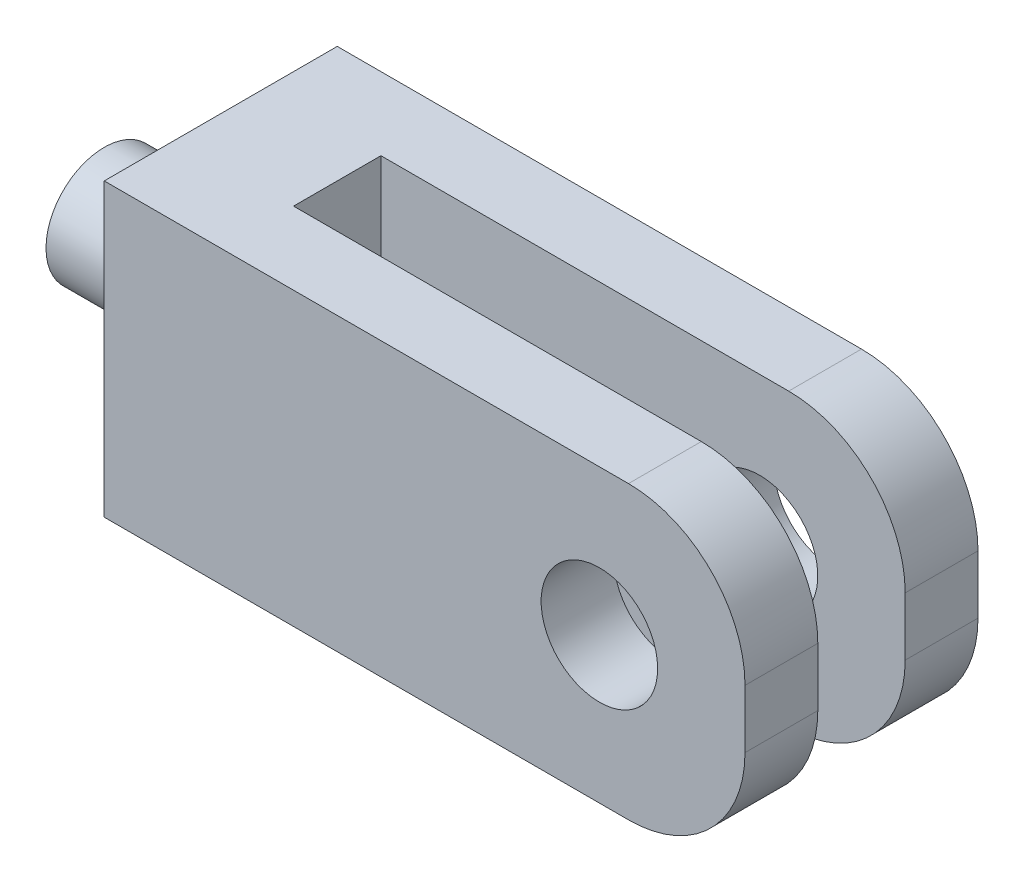
ISO-10303-21;
HEADER;
FILE_DESCRIPTION(('STEP AP214'),'2;1');
FILE_NAME('part.step','',(''),(''),'','','');
FILE_SCHEMA(('AUTOMOTIVE_DESIGN { 1 0 10303 214 1 1 1 1 }'));
ENDSEC;
DATA;
#1=APPLICATION_CONTEXT('core data for automotive mechanical design processes');
#2=APPLICATION_PROTOCOL_DEFINITION('international standard','automotive_design',2000,#1);
#3=PRODUCT_CONTEXT('',#1,'mechanical');
#4=PRODUCT('Part','Part','',(#3));
#5=PRODUCT_RELATED_PRODUCT_CATEGORY('part','',(#4));
#6=PRODUCT_DEFINITION_FORMATION('','',#4);
#7=PRODUCT_DEFINITION_CONTEXT('part definition',#1,'design');
#8=PRODUCT_DEFINITION('design','',#6,#7);
#9=PRODUCT_DEFINITION_SHAPE('','',#8);
#10=(LENGTH_UNIT() NAMED_UNIT(*) SI_UNIT(.MILLI.,.METRE.));
#11=(NAMED_UNIT(*) PLANE_ANGLE_UNIT() SI_UNIT($,.RADIAN.));
#12=(NAMED_UNIT(*) SI_UNIT($,.STERADIAN.) SOLID_ANGLE_UNIT());
#13=UNCERTAINTY_MEASURE_WITH_UNIT(LENGTH_MEASURE(1.E-05),#10,'distance_accuracy_value','');
#14=(GEOMETRIC_REPRESENTATION_CONTEXT(3) GLOBAL_UNCERTAINTY_ASSIGNED_CONTEXT((#13)) GLOBAL_UNIT_ASSIGNED_CONTEXT((#10,
#11,#12)) REPRESENTATION_CONTEXT('',''));
#15=CARTESIAN_POINT('',(0.,0.,0.));
#16=DIRECTION('',(0.,0.,1.));
#17=DIRECTION('',(1.,0.,0.));
#18=AXIS2_PLACEMENT_3D('',#15,#16,#17);
#19=CARTESIAN_POINT('',(55.,-25.,40.));
#20=DIRECTION('',(-1.,0.,0.));
#21=DIRECTION('',(0.,0.,1.));
#22=AXIS2_PLACEMENT_3D('',#19,#20,#21);
#23=PLANE('',#22);
#24=DIRECTION('',(0.,1.,0.));
#25=VECTOR('',#24,1.);
#26=CARTESIAN_POINT('',(55.,-25.,40.));
#27=LINE('',#26,#25);
#28=CARTESIAN_POINT('',(55.,-5.,40.));
#29=VERTEX_POINT('',#28);
#30=CARTESIAN_POINT('',(55.,5.,40.));
#31=VERTEX_POINT('',#30);
#32=EDGE_CURVE('E162',#29,#31,#27,.T.);
#33=ORIENTED_EDGE('',*,*,#32,.F.);
#34=DIRECTION('',(0.,0.,-1.));
#35=VECTOR('',#34,1.);
#36=CARTESIAN_POINT('',(55.,-5.,40.));
#37=LINE('',#36,#35);
#38=CARTESIAN_POINT('',(55.,-5.,27.5));
#39=VERTEX_POINT('',#38);
#40=EDGE_CURVE('E204',#29,#39,#37,.T.);
#41=ORIENTED_EDGE('',*,*,#40,.T.);
#42=DIRECTION('',(0.,-1.,0.));
#43=VECTOR('',#42,1.);
#44=CARTESIAN_POINT('',(55.,-25.,27.5));
#45=LINE('',#44,#43);
#46=CARTESIAN_POINT('',(55.,5.,27.5));
#47=VERTEX_POINT('',#46);
#48=EDGE_CURVE('E242',#47,#39,#45,.T.);
#49=ORIENTED_EDGE('',*,*,#48,.F.);
#50=DIRECTION('',(0.,0.,-1.));
#51=VECTOR('',#50,1.);
#52=CARTESIAN_POINT('',(55.,5.,40.));
#53=LINE('',#52,#51);
#54=EDGE_CURVE('E202',#47,#31,#53,.F.);
#55=ORIENTED_EDGE('',*,*,#54,.T.);
#56=EDGE_LOOP('',(#33,#41,#49,#55));
#57=FACE_BOUND('',#56,.T.);
#58=ADVANCED_FACE('F37',(#57),#23,.F.);
#59=DIRECTION('',(0.,1.,0.));
#60=VECTOR('',#59,1.);
#61=CARTESIAN_POINT('',(55.,-25.,12.5));
#62=LINE('',#61,#60);
#63=CARTESIAN_POINT('',(55.,-5.,12.5));
#64=VERTEX_POINT('',#63);
#65=CARTESIAN_POINT('',(55.,5.,12.5));
#66=VERTEX_POINT('',#65);
#67=EDGE_CURVE('E246',#64,#66,#62,.T.);
#68=ORIENTED_EDGE('',*,*,#67,.F.);
#69=DIRECTION('',(0.,0.,-1.));
#70=VECTOR('',#69,1.);
#71=CARTESIAN_POINT('',(55.,-5.,40.));
#72=LINE('',#71,#70);
#73=CARTESIAN_POINT('',(55.,-5.,0.));
#74=VERTEX_POINT('',#73);
#75=EDGE_CURVE('E188',#64,#74,#72,.T.);
#76=ORIENTED_EDGE('',*,*,#75,.T.);
#77=DIRECTION('',(0.,1.,0.));
#78=VECTOR('',#77,1.);
#79=CARTESIAN_POINT('',(55.,-25.,0.));
#80=LINE('',#79,#78);
#81=CARTESIAN_POINT('',(55.,5.,0.));
#82=VERTEX_POINT('',#81);
#83=EDGE_CURVE('E173',#74,#82,#80,.T.);
#84=ORIENTED_EDGE('',*,*,#83,.T.);
#85=DIRECTION('',(0.,0.,-1.));
#86=VECTOR('',#85,1.);
#87=CARTESIAN_POINT('',(55.,5.,40.));
#88=LINE('',#87,#86);
#89=EDGE_CURVE('E186',#82,#66,#88,.F.);
#90=ORIENTED_EDGE('',*,*,#89,.T.);
#91=EDGE_LOOP('',(#68,#76,#84,#90));
#92=FACE_BOUND('',#91,.T.);
#93=ADVANCED_FACE('F267',(#92),#23,.F.);
#94=CARTESIAN_POINT('',(-55.,25.,40.));
#95=DIRECTION('',(0.,-1.,0.));
#96=DIRECTION('',(0.,0.,-1.));
#97=AXIS2_PLACEMENT_3D('',#94,#95,#96);
#98=PLANE('',#97);
#99=DIRECTION('',(1.,0.,0.));
#100=VECTOR('',#99,1.);
#101=CARTESIAN_POINT('',(-35.,25.,12.5));
#102=LINE('',#101,#100);
#103=CARTESIAN_POINT('',(-35.,25.,12.5));
#104=VERTEX_POINT('',#103);
#105=CARTESIAN_POINT('',(35.,25.,12.5));
#106=VERTEX_POINT('',#105);
#107=EDGE_CURVE('E137',#104,#106,#102,.T.);
#108=ORIENTED_EDGE('',*,*,#107,.T.);
#109=DIRECTION('',(0.,0.,-1.));
#110=VECTOR('',#109,1.);
#111=CARTESIAN_POINT('',(35.,25.,40.));
#112=LINE('',#111,#110);
#113=CARTESIAN_POINT('',(35.,25.,0.));
#114=VERTEX_POINT('',#113);
#115=EDGE_CURVE('E46',#106,#114,#112,.T.);
#116=ORIENTED_EDGE('',*,*,#115,.T.);
#117=DIRECTION('',(-1.,0.,0.));
#118=VECTOR('',#117,1.);
#119=CARTESIAN_POINT('',(-55.,25.,0.));
#120=LINE('',#119,#118);
#121=CARTESIAN_POINT('',(-55.,25.,0.));
#122=VERTEX_POINT('',#121);
#123=EDGE_CURVE('E176',#114,#122,#120,.T.);
#124=ORIENTED_EDGE('',*,*,#123,.T.);
#125=DIRECTION('',(0.,0.,-1.));
#126=VECTOR('',#125,1.);
#127=CARTESIAN_POINT('',(-55.,25.,40.));
#128=LINE('',#127,#126);
#129=CARTESIAN_POINT('',(-55.,25.,40.));
#130=VERTEX_POINT('',#129);
#131=EDGE_CURVE('E183',#130,#122,#128,.T.);
#132=ORIENTED_EDGE('',*,*,#131,.F.);
#133=DIRECTION('',(-1.,0.,0.));
#134=VECTOR('',#133,1.);
#135=CARTESIAN_POINT('',(-55.,25.,40.));
#136=LINE('',#135,#134);
#137=CARTESIAN_POINT('',(35.,25.,40.));
#138=VERTEX_POINT('',#137);
#139=EDGE_CURVE('E164',#138,#130,#136,.T.);
#140=ORIENTED_EDGE('',*,*,#139,.F.);
#141=DIRECTION('',(0.,0.,-1.));
#142=VECTOR('',#141,1.);
#143=CARTESIAN_POINT('',(35.,25.,40.));
#144=LINE('',#143,#142);
#145=CARTESIAN_POINT('',(35.,25.,27.5));
#146=VERTEX_POINT('',#145);
#147=EDGE_CURVE('E213',#138,#146,#144,.T.);
#148=ORIENTED_EDGE('',*,*,#147,.T.);
#149=DIRECTION('',(1.,0.,0.));
#150=VECTOR('',#149,1.);
#151=CARTESIAN_POINT('',(-35.,25.,27.5));
#152=LINE('',#151,#150);
#153=CARTESIAN_POINT('',(-35.,25.,27.5));
#154=VERTEX_POINT('',#153);
#155=EDGE_CURVE('E157',#154,#146,#152,.T.);
#156=ORIENTED_EDGE('',*,*,#155,.F.);
#157=DIRECTION('',(0.,0.,1.));
#158=VECTOR('',#157,1.);
#159=CARTESIAN_POINT('',(-35.,25.,12.5));
#160=LINE('',#159,#158);
#161=EDGE_CURVE('E141',#104,#154,#160,.T.);
#162=ORIENTED_EDGE('',*,*,#161,.F.);
#163=EDGE_LOOP('',(#108,#116,#124,#132,#140,#148,#156,#162));
#164=FACE_BOUND('',#163,.T.);
#165=ADVANCED_FACE('F218',(#164),#98,.F.);
#166=CARTESIAN_POINT('',(-55.,-25.,40.));
#167=DIRECTION('',(1.,0.,0.));
#168=DIRECTION('',(0.,0.,-1.));
#169=AXIS2_PLACEMENT_3D('',#166,#167,#168);
#170=PLANE('',#169);
#171=CARTESIAN_POINT('',(-55.,0.,20.));
#172=DIRECTION('',(-1.,0.,0.));
#173=DIRECTION('',(0.,0.,1.));
#174=AXIS2_PLACEMENT_3D('',#171,#172,#173);
#175=CIRCLE('',#174,10.);
#176=CARTESIAN_POINT('',(-55.,0.,30.));
#177=VERTEX_POINT('',#176);
#178=EDGE_CURVE('E11',#177,#177,#175,.T.);
#179=ORIENTED_EDGE('',*,*,#178,.F.);
#180=EDGE_LOOP('',(#179));
#181=FACE_BOUND('',#180,.T.);
#182=DIRECTION('',(0.,-1.,0.));
#183=VECTOR('',#182,1.);
#184=CARTESIAN_POINT('',(-55.,-25.,0.));
#185=LINE('',#184,#183);
#186=CARTESIAN_POINT('',(-55.,-25.,0.));
#187=VERTEX_POINT('',#186);
#188=EDGE_CURVE('E178',#122,#187,#185,.T.);
#189=ORIENTED_EDGE('',*,*,#188,.T.);
#190=DIRECTION('',(0.,0.,-1.));
#191=VECTOR('',#190,1.);
#192=CARTESIAN_POINT('',(-55.,-25.,40.));
#193=LINE('',#192,#191);
#194=CARTESIAN_POINT('',(-55.,-25.,40.));
#195=VERTEX_POINT('',#194);
#196=EDGE_CURVE('E172',#195,#187,#193,.T.);
#197=ORIENTED_EDGE('',*,*,#196,.F.);
#198=DIRECTION('',(0.,-1.,0.));
#199=VECTOR('',#198,1.);
#200=CARTESIAN_POINT('',(-55.,-25.,40.));
#201=LINE('',#200,#199);
#202=EDGE_CURVE('E167',#130,#195,#201,.T.);
#203=ORIENTED_EDGE('',*,*,#202,.F.);
#204=ORIENTED_EDGE('',*,*,#131,.T.);
#205=EDGE_LOOP('',(#189,#197,#203,#204));
#206=FACE_BOUND('',#205,.T.);
#207=ADVANCED_FACE('F229',(#181,#206),#170,.F.);
#208=CARTESIAN_POINT('',(-55.,-25.,40.));
#209=DIRECTION('',(0.,1.,0.));
#210=DIRECTION('',(0.,0.,1.));
#211=AXIS2_PLACEMENT_3D('',#208,#209,#210);
#212=PLANE('',#211);
#213=DIRECTION('',(1.,0.,0.));
#214=VECTOR('',#213,1.);
#215=CARTESIAN_POINT('',(-55.,-25.,0.));
#216=LINE('',#215,#214);
#217=CARTESIAN_POINT('',(35.,-25.,0.));
#218=VERTEX_POINT('',#217);
#219=EDGE_CURVE('E165',#187,#218,#216,.T.);
#220=ORIENTED_EDGE('',*,*,#219,.T.);
#221=DIRECTION('',(0.,0.,-1.));
#222=VECTOR('',#221,1.);
#223=CARTESIAN_POINT('',(35.,-25.,40.));
#224=LINE('',#223,#222);
#225=CARTESIAN_POINT('',(35.,-25.,12.5));
#226=VERTEX_POINT('',#225);
#227=EDGE_CURVE('E154',#218,#226,#224,.F.);
#228=ORIENTED_EDGE('',*,*,#227,.T.);
#229=DIRECTION('',(1.,0.,0.));
#230=VECTOR('',#229,1.);
#231=CARTESIAN_POINT('',(-35.,-25.,12.5));
#232=LINE('',#231,#230);
#233=CARTESIAN_POINT('',(-35.,-25.,12.5));
#234=VERTEX_POINT('',#233);
#235=EDGE_CURVE('E134',#234,#226,#232,.T.);
#236=ORIENTED_EDGE('',*,*,#235,.F.);
#237=DIRECTION('',(0.,0.,-1.));
#238=VECTOR('',#237,1.);
#239=CARTESIAN_POINT('',(-35.,-25.,12.5));
#240=LINE('',#239,#238);
#241=CARTESIAN_POINT('',(-35.,-25.,27.5));
#242=VERTEX_POINT('',#241);
#243=EDGE_CURVE('E142',#242,#234,#240,.T.);
#244=ORIENTED_EDGE('',*,*,#243,.F.);
#245=DIRECTION('',(1.,0.,0.));
#246=VECTOR('',#245,1.);
#247=CARTESIAN_POINT('',(-35.,-25.,27.5));
#248=LINE('',#247,#246);
#249=CARTESIAN_POINT('',(35.,-25.,27.5));
#250=VERTEX_POINT('',#249);
#251=EDGE_CURVE('E155',#242,#250,#248,.T.);
#252=ORIENTED_EDGE('',*,*,#251,.T.);
#253=DIRECTION('',(0.,0.,-1.));
#254=VECTOR('',#253,1.);
#255=CARTESIAN_POINT('',(35.,-25.,40.));
#256=LINE('',#255,#254);
#257=CARTESIAN_POINT('',(35.,-25.,40.));
#258=VERTEX_POINT('',#257);
#259=EDGE_CURVE('E195',#250,#258,#256,.F.);
#260=ORIENTED_EDGE('',*,*,#259,.T.);
#261=DIRECTION('',(1.,0.,0.));
#262=VECTOR('',#261,1.);
#263=CARTESIAN_POINT('',(-55.,-25.,40.));
#264=LINE('',#263,#262);
#265=EDGE_CURVE('E169',#195,#258,#264,.T.);
#266=ORIENTED_EDGE('',*,*,#265,.F.);
#267=ORIENTED_EDGE('',*,*,#196,.T.);
#268=EDGE_LOOP('',(#220,#228,#236,#244,#252,#260,#266,#267));
#269=FACE_BOUND('',#268,.T.);
#270=ADVANCED_FACE('F152',(#269),#212,.F.);
#271=CARTESIAN_POINT('',(0.,0.,40.));
#272=DIRECTION('',(0.,0.,-1.));
#273=DIRECTION('',(-1.,0.,0.));
#274=AXIS2_PLACEMENT_3D('',#271,#272,#273);
#275=PLANE('',#274);
#276=CARTESIAN_POINT('',(30.,0.,40.));
#277=DIRECTION('',(0.,0.,1.));
#278=DIRECTION('',(1.,0.,0.));
#279=AXIS2_PLACEMENT_3D('',#276,#277,#278);
#280=CIRCLE('',#279,10.);
#281=CARTESIAN_POINT('',(40.,0.,40.));
#282=VERTEX_POINT('',#281);
#283=EDGE_CURVE('E453',#282,#282,#280,.T.);
#284=ORIENTED_EDGE('',*,*,#283,.F.);
#285=EDGE_LOOP('',(#284));
#286=FACE_BOUND('',#285,.T.);
#287=ORIENTED_EDGE('',*,*,#265,.T.);
#288=CARTESIAN_POINT('',(35.,-5.,40.));
#289=DIRECTION('',(0.,0.,-1.));
#290=DIRECTION('',(-1.,0.,0.));
#291=AXIS2_PLACEMENT_3D('',#288,#289,#290);
#292=CIRCLE('',#291,20.);
#293=EDGE_CURVE('E211',#258,#29,#292,.F.);
#294=ORIENTED_EDGE('',*,*,#293,.T.);
#295=ORIENTED_EDGE('',*,*,#32,.T.);
#296=CARTESIAN_POINT('',(35.,5.,40.));
#297=DIRECTION('',(0.,0.,-1.));
#298=DIRECTION('',(-1.,0.,0.));
#299=AXIS2_PLACEMENT_3D('',#296,#297,#298);
#300=CIRCLE('',#299,20.);
#301=EDGE_CURVE('E54',#31,#138,#300,.F.);
#302=ORIENTED_EDGE('',*,*,#301,.T.);
#303=ORIENTED_EDGE('',*,*,#139,.T.);
#304=ORIENTED_EDGE('',*,*,#202,.T.);
#305=EDGE_LOOP('',(#287,#294,#295,#302,#303,#304));
#306=FACE_BOUND('',#305,.T.);
#307=ADVANCED_FACE('F234',(#286,#306),#275,.F.);
#308=CARTESIAN_POINT('',(0.,0.,0.));
#309=DIRECTION('',(0.,0.,-1.));
#310=DIRECTION('',(-1.,0.,0.));
#311=AXIS2_PLACEMENT_3D('',#308,#309,#310);
#312=PLANE('',#311);
#313=CARTESIAN_POINT('',(30.,0.,0.));
#314=DIRECTION('',(0.,0.,-1.));
#315=DIRECTION('',(-1.,0.,0.));
#316=AXIS2_PLACEMENT_3D('',#313,#314,#315);
#317=CIRCLE('',#316,10.);
#318=CARTESIAN_POINT('',(20.,0.,0.));
#319=VERTEX_POINT('',#318);
#320=EDGE_CURVE('E247',#319,#319,#317,.T.);
#321=ORIENTED_EDGE('',*,*,#320,.F.);
#322=EDGE_LOOP('',(#321));
#323=FACE_BOUND('',#322,.T.);
#324=ORIENTED_EDGE('',*,*,#83,.F.);
#325=CARTESIAN_POINT('',(35.,-5.,0.));
#326=DIRECTION('',(0.,0.,-1.));
#327=DIRECTION('',(-1.,0.,0.));
#328=AXIS2_PLACEMENT_3D('',#325,#326,#327);
#329=CIRCLE('',#328,20.);
#330=EDGE_CURVE('E193',#74,#218,#329,.T.);
#331=ORIENTED_EDGE('',*,*,#330,.T.);
#332=ORIENTED_EDGE('',*,*,#219,.F.);
#333=ORIENTED_EDGE('',*,*,#188,.F.);
#334=ORIENTED_EDGE('',*,*,#123,.F.);
#335=CARTESIAN_POINT('',(35.,5.,0.));
#336=DIRECTION('',(0.,0.,-1.));
#337=DIRECTION('',(-1.,0.,0.));
#338=AXIS2_PLACEMENT_3D('',#335,#336,#337);
#339=CIRCLE('',#338,20.);
#340=EDGE_CURVE('E191',#114,#82,#339,.T.);
#341=ORIENTED_EDGE('',*,*,#340,.T.);
#342=EDGE_LOOP('',(#324,#331,#332,#333,#334,#341));
#343=FACE_BOUND('',#342,.T.);
#344=ADVANCED_FACE('F225',(#323,#343),#312,.T.);
#345=CARTESIAN_POINT('',(-35.,-25.,27.5));
#346=DIRECTION('',(0.,0.,1.));
#347=DIRECTION('',(1.,0.,0.));
#348=AXIS2_PLACEMENT_3D('',#345,#346,#347);
#349=PLANE('',#348);
#350=CARTESIAN_POINT('',(30.,0.,27.5));
#351=DIRECTION('',(0.,0.,1.));
#352=DIRECTION('',(1.,0.,0.));
#353=AXIS2_PLACEMENT_3D('',#350,#351,#352);
#354=CIRCLE('',#353,10.);
#355=CARTESIAN_POINT('',(40.,0.,27.5));
#356=VERTEX_POINT('',#355);
#357=EDGE_CURVE('E252',#356,#356,#354,.T.);
#358=ORIENTED_EDGE('',*,*,#357,.T.);
#359=EDGE_LOOP('',(#358));
#360=FACE_BOUND('',#359,.T.);
#361=ORIENTED_EDGE('',*,*,#48,.T.);
#362=CARTESIAN_POINT('',(35.,-5.,27.5));
#363=DIRECTION('',(0.,0.,1.));
#364=DIRECTION('',(1.,0.,0.));
#365=AXIS2_PLACEMENT_3D('',#362,#363,#364);
#366=CIRCLE('',#365,20.);
#367=EDGE_CURVE('E208',#39,#250,#366,.F.);
#368=ORIENTED_EDGE('',*,*,#367,.T.);
#369=ORIENTED_EDGE('',*,*,#251,.F.);
#370=DIRECTION('',(0.,-1.,0.));
#371=VECTOR('',#370,1.);
#372=CARTESIAN_POINT('',(-35.,-25.,27.5));
#373=LINE('',#372,#371);
#374=EDGE_CURVE('E146',#154,#242,#373,.T.);
#375=ORIENTED_EDGE('',*,*,#374,.F.);
#376=ORIENTED_EDGE('',*,*,#155,.T.);
#377=CARTESIAN_POINT('',(35.,5.,27.5));
#378=DIRECTION('',(0.,0.,1.));
#379=DIRECTION('',(1.,0.,0.));
#380=AXIS2_PLACEMENT_3D('',#377,#378,#379);
#381=CIRCLE('',#380,20.);
#382=EDGE_CURVE('E62',#146,#47,#381,.F.);
#383=ORIENTED_EDGE('',*,*,#382,.T.);
#384=EDGE_LOOP('',(#361,#368,#369,#375,#376,#383));
#385=FACE_BOUND('',#384,.T.);
#386=ADVANCED_FACE('F244',(#360,#385),#349,.F.);
#387=CARTESIAN_POINT('',(-35.,-25.,12.5));
#388=DIRECTION('',(0.,0.,-1.));
#389=DIRECTION('',(-1.,0.,0.));
#390=AXIS2_PLACEMENT_3D('',#387,#388,#389);
#391=PLANE('',#390);
#392=CARTESIAN_POINT('',(30.,0.,12.5));
#393=DIRECTION('',(0.,0.,-1.));
#394=DIRECTION('',(-1.,0.,0.));
#395=AXIS2_PLACEMENT_3D('',#392,#393,#394);
#396=CIRCLE('',#395,10.);
#397=CARTESIAN_POINT('',(20.,0.,12.5));
#398=VERTEX_POINT('',#397);
#399=EDGE_CURVE('E41',#398,#398,#396,.T.);
#400=ORIENTED_EDGE('',*,*,#399,.T.);
#401=EDGE_LOOP('',(#400));
#402=FACE_BOUND('',#401,.T.);
#403=ORIENTED_EDGE('',*,*,#235,.T.);
#404=CARTESIAN_POINT('',(35.,-5.,12.5));
#405=DIRECTION('',(0.,0.,-1.));
#406=DIRECTION('',(-1.,0.,0.));
#407=AXIS2_PLACEMENT_3D('',#404,#405,#406);
#408=CIRCLE('',#407,20.);
#409=EDGE_CURVE('E200',#226,#64,#408,.F.);
#410=ORIENTED_EDGE('',*,*,#409,.T.);
#411=ORIENTED_EDGE('',*,*,#67,.T.);
#412=CARTESIAN_POINT('',(35.,5.,12.5));
#413=DIRECTION('',(0.,0.,-1.));
#414=DIRECTION('',(-1.,0.,0.));
#415=AXIS2_PLACEMENT_3D('',#412,#413,#414);
#416=CIRCLE('',#415,20.);
#417=EDGE_CURVE('E198',#66,#106,#416,.F.);
#418=ORIENTED_EDGE('',*,*,#417,.T.);
#419=ORIENTED_EDGE('',*,*,#107,.F.);
#420=DIRECTION('',(0.,1.,0.));
#421=VECTOR('',#420,1.);
#422=CARTESIAN_POINT('',(-35.,-25.,12.5));
#423=LINE('',#422,#421);
#424=EDGE_CURVE('E130',#234,#104,#423,.T.);
#425=ORIENTED_EDGE('',*,*,#424,.F.);
#426=EDGE_LOOP('',(#403,#410,#411,#418,#419,#425));
#427=FACE_BOUND('',#426,.T.);
#428=ADVANCED_FACE('F132',(#402,#427),#391,.F.);
#429=CARTESIAN_POINT('',(-35.,0.,0.));
#430=DIRECTION('',(1.,0.,0.));
#431=DIRECTION('',(0.,0.,-1.));
#432=AXIS2_PLACEMENT_3D('',#429,#430,#431);
#433=PLANE('',#432);
#434=ORIENTED_EDGE('',*,*,#374,.T.);
#435=ORIENTED_EDGE('',*,*,#243,.T.);
#436=ORIENTED_EDGE('',*,*,#424,.T.);
#437=ORIENTED_EDGE('',*,*,#161,.T.);
#438=EDGE_LOOP('',(#434,#435,#436,#437));
#439=FACE_BOUND('',#438,.T.);
#440=ADVANCED_FACE('F145',(#439),#433,.T.);
#441=CARTESIAN_POINT('',(35.,-5.,40.));
#442=DIRECTION('',(0.,0.,-1.));
#443=DIRECTION('',(-1.,0.,0.));
#444=AXIS2_PLACEMENT_3D('',#441,#442,#443);
#445=CYLINDRICAL_SURFACE('',#444,20.);
#446=ORIENTED_EDGE('',*,*,#409,.F.);
#447=ORIENTED_EDGE('',*,*,#227,.F.);
#448=ORIENTED_EDGE('',*,*,#330,.F.);
#449=ORIENTED_EDGE('',*,*,#75,.F.);
#450=EDGE_LOOP('',(#446,#447,#448,#449));
#451=FACE_BOUND('',#450,.T.);
#452=ADVANCED_FACE('F276',(#451),#445,.T.);
#453=CARTESIAN_POINT('',(35.,-5.,40.));
#454=DIRECTION('',(0.,0.,-1.));
#455=DIRECTION('',(-1.,0.,0.));
#456=AXIS2_PLACEMENT_3D('',#453,#454,#455);
#457=CYLINDRICAL_SURFACE('',#456,20.);
#458=ORIENTED_EDGE('',*,*,#293,.F.);
#459=ORIENTED_EDGE('',*,*,#259,.F.);
#460=ORIENTED_EDGE('',*,*,#367,.F.);
#461=ORIENTED_EDGE('',*,*,#40,.F.);
#462=EDGE_LOOP('',(#458,#459,#460,#461));
#463=FACE_BOUND('',#462,.T.);
#464=ADVANCED_FACE('F238',(#463),#457,.T.);
#465=CARTESIAN_POINT('',(35.,5.,40.));
#466=DIRECTION('',(0.,0.,-1.));
#467=DIRECTION('',(-1.,0.,0.));
#468=AXIS2_PLACEMENT_3D('',#465,#466,#467);
#469=CYLINDRICAL_SURFACE('',#468,20.);
#470=ORIENTED_EDGE('',*,*,#417,.F.);
#471=ORIENTED_EDGE('',*,*,#89,.F.);
#472=ORIENTED_EDGE('',*,*,#340,.F.);
#473=ORIENTED_EDGE('',*,*,#115,.F.);
#474=EDGE_LOOP('',(#470,#471,#472,#473));
#475=FACE_BOUND('',#474,.T.);
#476=ADVANCED_FACE('F258',(#475),#469,.T.);
#477=CARTESIAN_POINT('',(35.,5.,40.));
#478=DIRECTION('',(0.,0.,-1.));
#479=DIRECTION('',(-1.,0.,0.));
#480=AXIS2_PLACEMENT_3D('',#477,#478,#479);
#481=CYLINDRICAL_SURFACE('',#480,20.);
#482=ORIENTED_EDGE('',*,*,#301,.F.);
#483=ORIENTED_EDGE('',*,*,#54,.F.);
#484=ORIENTED_EDGE('',*,*,#382,.F.);
#485=ORIENTED_EDGE('',*,*,#147,.F.);
#486=EDGE_LOOP('',(#482,#483,#484,#485));
#487=FACE_BOUND('',#486,.T.);
#488=ADVANCED_FACE('F39',(#487),#481,.T.);
#489=CARTESIAN_POINT('',(30.,0.,-50.));
#490=DIRECTION('',(0.,0.,1.));
#491=DIRECTION('',(1.,0.,0.));
#492=AXIS2_PLACEMENT_3D('',#489,#490,#491);
#493=CYLINDRICAL_SURFACE('',#492,10.);
#494=ORIENTED_EDGE('',*,*,#320,.T.);
#495=EDGE_LOOP('',(#494));
#496=FACE_BOUND('',#495,.T.);
#497=ORIENTED_EDGE('',*,*,#399,.F.);
#498=EDGE_LOOP('',(#497));
#499=FACE_BOUND('',#498,.T.);
#500=ADVANCED_FACE('F257',(#496,#499),#493,.F.);
#501=ORIENTED_EDGE('',*,*,#283,.T.);
#502=EDGE_LOOP('',(#501));
#503=FACE_BOUND('',#502,.T.);
#504=ORIENTED_EDGE('',*,*,#357,.F.);
#505=EDGE_LOOP('',(#504));
#506=FACE_BOUND('',#505,.T.);
#507=ADVANCED_FACE('F263',(#503,#506),#493,.F.);
#508=CARTESIAN_POINT('',(-75.,0.,20.));
#509=DIRECTION('',(1.,0.,0.));
#510=DIRECTION('',(0.,0.,-1.));
#511=AXIS2_PLACEMENT_3D('',#508,#509,#510);
#512=CYLINDRICAL_SURFACE('',#511,10.);
#513=CARTESIAN_POINT('',(-75.,0.,20.));
#514=DIRECTION('',(-1.,0.,0.));
#515=DIRECTION('',(0.,0.,1.));
#516=AXIS2_PLACEMENT_3D('',#513,#514,#515);
#517=CIRCLE('',#516,10.);
#518=CARTESIAN_POINT('',(-75.,0.,30.));
#519=VERTEX_POINT('',#518);
#520=EDGE_CURVE('E452',#519,#519,#517,.T.);
#521=ORIENTED_EDGE('',*,*,#520,.F.);
#522=EDGE_LOOP('',(#521));
#523=FACE_BOUND('',#522,.T.);
#524=ORIENTED_EDGE('',*,*,#178,.T.);
#525=EDGE_LOOP('',(#524));
#526=FACE_BOUND('',#525,.T.);
#527=ADVANCED_FACE('F356',(#523,#526),#512,.T.);
#528=CARTESIAN_POINT('',(-75.,0.,20.));
#529=DIRECTION('',(-1.,0.,0.));
#530=DIRECTION('',(0.,0.,1.));
#531=AXIS2_PLACEMENT_3D('',#528,#529,#530);
#532=PLANE('',#531);
#533=ORIENTED_EDGE('',*,*,#520,.T.);
#534=EDGE_LOOP('',(#533));
#535=FACE_BOUND('',#534,.T.);
#536=ADVANCED_FACE('F377',(#535),#532,.T.);
#537=CLOSED_SHELL('',(#58,#93,#165,#207,#270,#307,#344,#386,#428,#440,#452,#464,#476,#488,#500,
#507,#527,#536));
#538=MANIFOLD_SOLID_BREP('B2',#537);
#539=ADVANCED_BREP_SHAPE_REPRESENTATION('',(#18,#538),#14);
#540=SHAPE_DEFINITION_REPRESENTATION(#9,#539);
ENDSEC;
END-ISO-10303-21;
